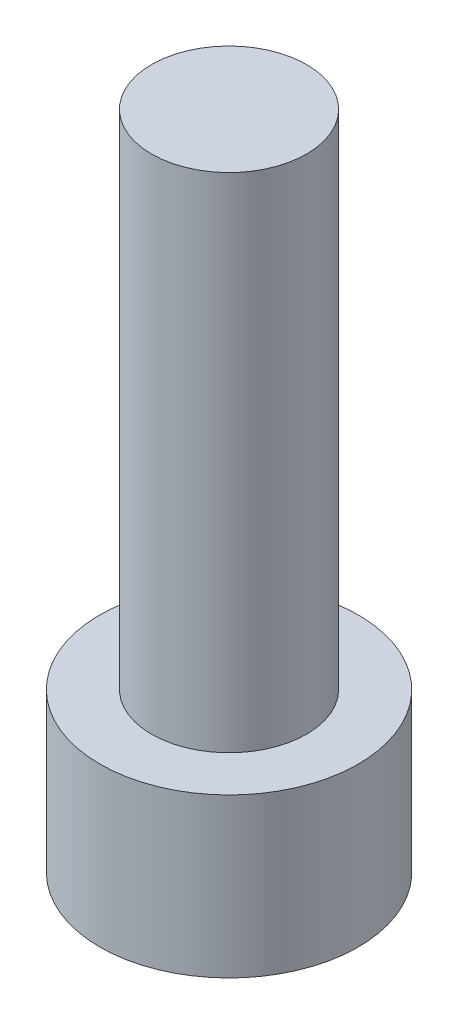
ISO-10303-21;
HEADER;
FILE_DESCRIPTION(('STEP AP214'),'2;1');
FILE_NAME('part.step','',(''),(''),'','','');
FILE_SCHEMA(('AUTOMOTIVE_DESIGN { 1 0 10303 214 1 1 1 1 }'));
ENDSEC;
DATA;
#1=APPLICATION_CONTEXT('core data for automotive mechanical design processes');
#2=APPLICATION_PROTOCOL_DEFINITION('international standard','automotive_design',2000,#1);
#3=PRODUCT_CONTEXT('',#1,'mechanical');
#4=PRODUCT('Part','Part','',(#3));
#5=PRODUCT_RELATED_PRODUCT_CATEGORY('part','',(#4));
#6=PRODUCT_DEFINITION_FORMATION('','',#4);
#7=PRODUCT_DEFINITION_CONTEXT('part definition',#1,'design');
#8=PRODUCT_DEFINITION('design','',#6,#7);
#9=PRODUCT_DEFINITION_SHAPE('','',#8);
#10=(LENGTH_UNIT() NAMED_UNIT(*) SI_UNIT(.MILLI.,.METRE.));
#11=(NAMED_UNIT(*) PLANE_ANGLE_UNIT() SI_UNIT($,.RADIAN.));
#12=(NAMED_UNIT(*) SI_UNIT($,.STERADIAN.) SOLID_ANGLE_UNIT());
#13=UNCERTAINTY_MEASURE_WITH_UNIT(LENGTH_MEASURE(1.E-05),#10,'distance_accuracy_value','');
#14=(GEOMETRIC_REPRESENTATION_CONTEXT(3) GLOBAL_UNCERTAINTY_ASSIGNED_CONTEXT((#13)) GLOBAL_UNIT_ASSIGNED_CONTEXT((#10,
#11,#12)) REPRESENTATION_CONTEXT('',''));
#15=CARTESIAN_POINT('',(0.,0.,0.));
#16=DIRECTION('',(0.,0.,1.));
#17=DIRECTION('',(1.,0.,0.));
#18=AXIS2_PLACEMENT_3D('',#15,#16,#17);
#19=CARTESIAN_POINT('',(0.,3.5052,0.));
#20=DIRECTION('',(0.,1.,0.));
#21=DIRECTION('',(0.,0.,1.));
#22=AXIS2_PLACEMENT_3D('',#19,#20,#21);
#23=PLANE('',#22);
#24=CARTESIAN_POINT('',(0.,3.5052,0.));
#25=DIRECTION('',(0.,1.,0.));
#26=DIRECTION('',(0.,0.,1.));
#27=AXIS2_PLACEMENT_3D('',#24,#25,#26);
#28=CIRCLE('',#27,2.8575);
#29=CARTESIAN_POINT('',(0.,3.5052,2.8575));
#30=VERTEX_POINT('',#29);
#31=EDGE_CURVE('E11',#30,#30,#28,.T.);
#32=ORIENTED_EDGE('',*,*,#31,.T.);
#33=EDGE_LOOP('',(#32));
#34=FACE_BOUND('',#33,.T.);
#35=CARTESIAN_POINT('',(0.,3.5052,0.));
#36=DIRECTION('',(0.,1.,0.));
#37=DIRECTION('',(0.,0.,1.));
#38=AXIS2_PLACEMENT_3D('',#35,#36,#37);
#39=CIRCLE('',#38,1.7145);
#40=CARTESIAN_POINT('',(0.,3.5052,1.7145));
#41=VERTEX_POINT('',#40);
#42=EDGE_CURVE('E154',#41,#41,#39,.T.);
#43=ORIENTED_EDGE('',*,*,#42,.F.);
#44=EDGE_LOOP('',(#43));
#45=FACE_BOUND('',#44,.T.);
#46=ADVANCED_FACE('F35',(#34,#45),#23,.T.);
#47=CARTESIAN_POINT('',(0.,3.5052,0.));
#48=DIRECTION('',(0.,-1.,0.));
#49=DIRECTION('',(0.,0.,-1.));
#50=AXIS2_PLACEMENT_3D('',#47,#48,#49);
#51=CYLINDRICAL_SURFACE('',#50,2.8575);
#52=ORIENTED_EDGE('',*,*,#31,.F.);
#53=EDGE_LOOP('',(#52));
#54=FACE_BOUND('',#53,.T.);
#55=CARTESIAN_POINT('',(0.,0.,0.));
#56=DIRECTION('',(0.,1.,0.));
#57=DIRECTION('',(0.,0.,1.));
#58=AXIS2_PLACEMENT_3D('',#55,#56,#57);
#59=CIRCLE('',#58,2.8575);
#60=CARTESIAN_POINT('',(0.,0.,2.8575));
#61=VERTEX_POINT('',#60);
#62=EDGE_CURVE('E39',#61,#61,#59,.T.);
#63=ORIENTED_EDGE('',*,*,#62,.T.);
#64=EDGE_LOOP('',(#63));
#65=FACE_BOUND('',#64,.T.);
#66=ADVANCED_FACE('F37',(#54,#65),#51,.T.);
#67=CARTESIAN_POINT('',(0.,0.,0.));
#68=DIRECTION('',(0.,1.,0.));
#69=DIRECTION('',(0.,0.,1.));
#70=AXIS2_PLACEMENT_3D('',#67,#68,#69);
#71=PLANE('',#70);
#72=DIRECTION('',(-0.500000000000001,0.,0.866025403784438));
#73=VECTOR('',#72,1.);
#74=CARTESIAN_POINT('',(1.60395121659243,0.,0.));
#75=LINE('',#74,#73);
#76=CARTESIAN_POINT('',(1.60395121659243,0.,0.));
#77=VERTEX_POINT('',#76);
#78=CARTESIAN_POINT('',(0.801975608296214,0.,1.3890625));
#79=VERTEX_POINT('',#78);
#80=EDGE_CURVE('E124',#77,#79,#75,.T.);
#81=ORIENTED_EDGE('',*,*,#80,.F.);
#82=DIRECTION('',(0.5,0.,0.866025403784439));
#83=VECTOR('',#82,1.);
#84=CARTESIAN_POINT('',(0.801975608296215,0.,-1.3890625));
#85=LINE('',#84,#83);
#86=CARTESIAN_POINT('',(0.801975608296215,0.,-1.3890625));
#87=VERTEX_POINT('',#86);
#88=EDGE_CURVE('E50',#87,#77,#85,.T.);
#89=ORIENTED_EDGE('',*,*,#88,.F.);
#90=DIRECTION('',(1.,0.,0.));
#91=VECTOR('',#90,1.);
#92=CARTESIAN_POINT('',(-0.801975608296214,0.,-1.3890625));
#93=LINE('',#92,#91);
#94=CARTESIAN_POINT('',(-0.801975608296214,0.,-1.3890625));
#95=VERTEX_POINT('',#94);
#96=EDGE_CURVE('E134',#95,#87,#93,.T.);
#97=ORIENTED_EDGE('',*,*,#96,.F.);
#98=DIRECTION('',(0.5,0.,-0.866025403784438));
#99=VECTOR('',#98,1.);
#100=CARTESIAN_POINT('',(-1.60395121659243,0.,0.));
#101=LINE('',#100,#99);
#102=CARTESIAN_POINT('',(-1.60395121659243,0.,0.));
#103=VERTEX_POINT('',#102);
#104=EDGE_CURVE('E132',#103,#95,#101,.T.);
#105=ORIENTED_EDGE('',*,*,#104,.F.);
#106=DIRECTION('',(-0.5,0.,-0.866025403784439));
#107=VECTOR('',#106,1.);
#108=CARTESIAN_POINT('',(-0.801975608296214,0.,1.3890625));
#109=LINE('',#108,#107);
#110=CARTESIAN_POINT('',(-0.801975608296214,0.,1.3890625));
#111=VERTEX_POINT('',#110);
#112=EDGE_CURVE('E98',#111,#103,#109,.T.);
#113=ORIENTED_EDGE('',*,*,#112,.F.);
#114=DIRECTION('',(-1.,0.,0.));
#115=VECTOR('',#114,1.);
#116=CARTESIAN_POINT('',(0.801975608296214,0.,1.3890625));
#117=LINE('',#116,#115);
#118=EDGE_CURVE('E128',#79,#111,#117,.T.);
#119=ORIENTED_EDGE('',*,*,#118,.F.);
#120=EDGE_LOOP('',(#81,#89,#97,#105,#113,#119));
#121=FACE_BOUND('',#120,.T.);
#122=ORIENTED_EDGE('',*,*,#62,.F.);
#123=EDGE_LOOP('',(#122));
#124=FACE_BOUND('',#123,.T.);
#125=ADVANCED_FACE('F147',(#121,#124),#71,.F.);
#126=CARTESIAN_POINT('',(0.801975608296215,1.9558,-1.3890625));
#127=DIRECTION('',(0.866025403784438,0.,-0.5));
#128=DIRECTION('',(-0.5,0.,-0.866025403784439));
#129=AXIS2_PLACEMENT_3D('',#126,#127,#128);
#130=PLANE('',#129);
#131=ORIENTED_EDGE('',*,*,#88,.T.);
#132=DIRECTION('',(0.,-1.,0.));
#133=VECTOR('',#132,1.);
#134=CARTESIAN_POINT('',(1.60395121659243,1.9558,0.));
#135=LINE('',#134,#133);
#136=CARTESIAN_POINT('',(1.60395121659243,1.9558,0.));
#137=VERTEX_POINT('',#136);
#138=EDGE_CURVE('E80',#137,#77,#135,.T.);
#139=ORIENTED_EDGE('',*,*,#138,.F.);
#140=DIRECTION('',(0.5,0.,0.866025403784439));
#141=VECTOR('',#140,1.);
#142=CARTESIAN_POINT('',(0.801975608296215,1.9558,-1.3890625));
#143=LINE('',#142,#141);
#144=CARTESIAN_POINT('',(0.801975608296215,1.9558,-1.3890625));
#145=VERTEX_POINT('',#144);
#146=EDGE_CURVE('E136',#145,#137,#143,.T.);
#147=ORIENTED_EDGE('',*,*,#146,.F.);
#148=DIRECTION('',(0.,-1.,0.));
#149=VECTOR('',#148,1.);
#150=CARTESIAN_POINT('',(0.801975608296215,1.9558,-1.3890625));
#151=LINE('',#150,#149);
#152=EDGE_CURVE('E58',#145,#87,#151,.T.);
#153=ORIENTED_EDGE('',*,*,#152,.T.);
#154=EDGE_LOOP('',(#131,#139,#147,#153));
#155=FACE_BOUND('',#154,.T.);
#156=ADVANCED_FACE('F176',(#155),#130,.F.);
#157=CARTESIAN_POINT('',(-0.801975608296214,1.9558,-1.3890625));
#158=DIRECTION('',(0.,0.,-1.));
#159=DIRECTION('',(-1.,0.,0.));
#160=AXIS2_PLACEMENT_3D('',#157,#158,#159);
#161=PLANE('',#160);
#162=ORIENTED_EDGE('',*,*,#96,.T.);
#163=ORIENTED_EDGE('',*,*,#152,.F.);
#164=DIRECTION('',(1.,0.,0.));
#165=VECTOR('',#164,1.);
#166=CARTESIAN_POINT('',(-0.801975608296214,1.9558,-1.3890625));
#167=LINE('',#166,#165);
#168=CARTESIAN_POINT('',(-0.801975608296214,1.9558,-1.3890625));
#169=VERTEX_POINT('',#168);
#170=EDGE_CURVE('E110',#169,#145,#167,.T.);
#171=ORIENTED_EDGE('',*,*,#170,.F.);
#172=DIRECTION('',(0.,-1.,0.));
#173=VECTOR('',#172,1.);
#174=CARTESIAN_POINT('',(-0.801975608296214,1.9558,-1.3890625));
#175=LINE('',#174,#173);
#176=EDGE_CURVE('E102',#169,#95,#175,.T.);
#177=ORIENTED_EDGE('',*,*,#176,.T.);
#178=EDGE_LOOP('',(#162,#163,#171,#177));
#179=FACE_BOUND('',#178,.T.);
#180=ADVANCED_FACE('F182',(#179),#161,.F.);
#181=CARTESIAN_POINT('',(-1.60395121659243,1.9558,0.));
#182=DIRECTION('',(-0.866025403784438,0.,-0.5));
#183=DIRECTION('',(-0.5,0.,0.866025403784439));
#184=AXIS2_PLACEMENT_3D('',#181,#182,#183);
#185=PLANE('',#184);
#186=ORIENTED_EDGE('',*,*,#104,.T.);
#187=ORIENTED_EDGE('',*,*,#176,.F.);
#188=DIRECTION('',(0.5,0.,-0.866025403784438));
#189=VECTOR('',#188,1.);
#190=CARTESIAN_POINT('',(-1.60395121659243,1.9558,0.));
#191=LINE('',#190,#189);
#192=CARTESIAN_POINT('',(-1.60395121659243,1.9558,0.));
#193=VERTEX_POINT('',#192);
#194=EDGE_CURVE('E106',#193,#169,#191,.T.);
#195=ORIENTED_EDGE('',*,*,#194,.F.);
#196=DIRECTION('',(0.,-1.,0.));
#197=VECTOR('',#196,1.);
#198=CARTESIAN_POINT('',(-1.60395121659243,1.9558,0.));
#199=LINE('',#198,#197);
#200=EDGE_CURVE('E91',#193,#103,#199,.T.);
#201=ORIENTED_EDGE('',*,*,#200,.T.);
#202=EDGE_LOOP('',(#186,#187,#195,#201));
#203=FACE_BOUND('',#202,.T.);
#204=ADVANCED_FACE('F107',(#203),#185,.F.);
#205=CARTESIAN_POINT('',(-0.801975608296214,1.9558,1.3890625));
#206=DIRECTION('',(-0.866025403784439,0.,0.5));
#207=DIRECTION('',(0.5,0.,0.866025403784439));
#208=AXIS2_PLACEMENT_3D('',#205,#206,#207);
#209=PLANE('',#208);
#210=ORIENTED_EDGE('',*,*,#112,.T.);
#211=ORIENTED_EDGE('',*,*,#200,.F.);
#212=DIRECTION('',(-0.5,0.,-0.866025403784439));
#213=VECTOR('',#212,1.);
#214=CARTESIAN_POINT('',(-0.801975608296214,1.9558,1.3890625));
#215=LINE('',#214,#213);
#216=CARTESIAN_POINT('',(-0.801975608296214,1.9558,1.3890625));
#217=VERTEX_POINT('',#216);
#218=EDGE_CURVE('E95',#217,#193,#215,.T.);
#219=ORIENTED_EDGE('',*,*,#218,.F.);
#220=DIRECTION('',(0.,-1.,0.));
#221=VECTOR('',#220,1.);
#222=CARTESIAN_POINT('',(-0.801975608296214,1.9558,1.3890625));
#223=LINE('',#222,#221);
#224=EDGE_CURVE('E103',#217,#111,#223,.T.);
#225=ORIENTED_EDGE('',*,*,#224,.T.);
#226=EDGE_LOOP('',(#210,#211,#219,#225));
#227=FACE_BOUND('',#226,.T.);
#228=ADVANCED_FACE('F93',(#227),#209,.F.);
#229=CARTESIAN_POINT('',(0.801975608296214,1.9558,1.3890625));
#230=DIRECTION('',(0.,0.,1.));
#231=DIRECTION('',(1.,0.,0.));
#232=AXIS2_PLACEMENT_3D('',#229,#230,#231);
#233=PLANE('',#232);
#234=ORIENTED_EDGE('',*,*,#118,.T.);
#235=ORIENTED_EDGE('',*,*,#224,.F.);
#236=DIRECTION('',(-1.,0.,0.));
#237=VECTOR('',#236,1.);
#238=CARTESIAN_POINT('',(0.801975608296214,1.9558,1.3890625));
#239=LINE('',#238,#237);
#240=CARTESIAN_POINT('',(0.801975608296214,1.9558,1.3890625));
#241=VERTEX_POINT('',#240);
#242=EDGE_CURVE('E116',#241,#217,#239,.T.);
#243=ORIENTED_EDGE('',*,*,#242,.F.);
#244=DIRECTION('',(0.,-1.,0.));
#245=VECTOR('',#244,1.);
#246=CARTESIAN_POINT('',(0.801975608296214,1.9558,1.3890625));
#247=LINE('',#246,#245);
#248=EDGE_CURVE('E140',#241,#79,#247,.T.);
#249=ORIENTED_EDGE('',*,*,#248,.T.);
#250=EDGE_LOOP('',(#234,#235,#243,#249));
#251=FACE_BOUND('',#250,.T.);
#252=ADVANCED_FACE('F151',(#251),#233,.F.);
#253=CARTESIAN_POINT('',(1.60395121659243,1.9558,0.));
#254=DIRECTION('',(0.866025403784438,0.,0.500000000000001));
#255=DIRECTION('',(0.500000000000001,0.,-0.866025403784438));
#256=AXIS2_PLACEMENT_3D('',#253,#254,#255);
#257=PLANE('',#256);
#258=ORIENTED_EDGE('',*,*,#80,.T.);
#259=ORIENTED_EDGE('',*,*,#248,.F.);
#260=DIRECTION('',(-0.500000000000001,0.,0.866025403784438));
#261=VECTOR('',#260,1.);
#262=CARTESIAN_POINT('',(1.60395121659243,1.9558,0.));
#263=LINE('',#262,#261);
#264=EDGE_CURVE('E118',#137,#241,#263,.T.);
#265=ORIENTED_EDGE('',*,*,#264,.F.);
#266=ORIENTED_EDGE('',*,*,#138,.T.);
#267=EDGE_LOOP('',(#258,#259,#265,#266));
#268=FACE_BOUND('',#267,.T.);
#269=ADVANCED_FACE('F144',(#268),#257,.F.);
#270=CARTESIAN_POINT('',(0.,1.9558,0.));
#271=DIRECTION('',(0.,-1.,0.));
#272=DIRECTION('',(0.,0.,-1.));
#273=AXIS2_PLACEMENT_3D('',#270,#271,#272);
#274=PLANE('',#273);
#275=ORIENTED_EDGE('',*,*,#146,.T.);
#276=ORIENTED_EDGE('',*,*,#264,.T.);
#277=ORIENTED_EDGE('',*,*,#242,.T.);
#278=ORIENTED_EDGE('',*,*,#218,.T.);
#279=ORIENTED_EDGE('',*,*,#194,.T.);
#280=ORIENTED_EDGE('',*,*,#170,.T.);
#281=EDGE_LOOP('',(#275,#276,#277,#278,#279,#280));
#282=FACE_BOUND('',#281,.T.);
#283=ADVANCED_FACE('F113',(#282),#274,.T.);
#284=CARTESIAN_POINT('',(0.,14.6177,0.));
#285=DIRECTION('',(0.,-1.,0.));
#286=DIRECTION('',(0.,0.,-1.));
#287=AXIS2_PLACEMENT_3D('',#284,#285,#286);
#288=CYLINDRICAL_SURFACE('',#287,1.7145);
#289=CARTESIAN_POINT('',(0.,14.6177,0.));
#290=DIRECTION('',(0.,1.,0.));
#291=DIRECTION('',(0.,0.,1.));
#292=AXIS2_PLACEMENT_3D('',#289,#290,#291);
#293=CIRCLE('',#292,1.7145);
#294=CARTESIAN_POINT('',(0.,14.6177,1.7145));
#295=VERTEX_POINT('',#294);
#296=EDGE_CURVE('E125',#295,#295,#293,.T.);
#297=ORIENTED_EDGE('',*,*,#296,.F.);
#298=EDGE_LOOP('',(#297));
#299=FACE_BOUND('',#298,.T.);
#300=ORIENTED_EDGE('',*,*,#42,.T.);
#301=EDGE_LOOP('',(#300));
#302=FACE_BOUND('',#301,.T.);
#303=ADVANCED_FACE('F162',(#299,#302),#288,.T.);
#304=CARTESIAN_POINT('',(0.,14.6177,0.));
#305=DIRECTION('',(0.,1.,0.));
#306=DIRECTION('',(0.,0.,1.));
#307=AXIS2_PLACEMENT_3D('',#304,#305,#306);
#308=PLANE('',#307);
#309=ORIENTED_EDGE('',*,*,#296,.T.);
#310=EDGE_LOOP('',(#309));
#311=FACE_BOUND('',#310,.T.);
#312=ADVANCED_FACE('F160',(#311),#308,.T.);
#313=CLOSED_SHELL('',(#46,#66,#125,#156,#180,#204,#228,#252,#269,#283,#303,#312));
#314=MANIFOLD_SOLID_BREP('B2',#313);
#315=ADVANCED_BREP_SHAPE_REPRESENTATION('',(#18,#314),#14);
#316=SHAPE_DEFINITION_REPRESENTATION(#9,#315);
ENDSEC;
END-ISO-10303-21;
